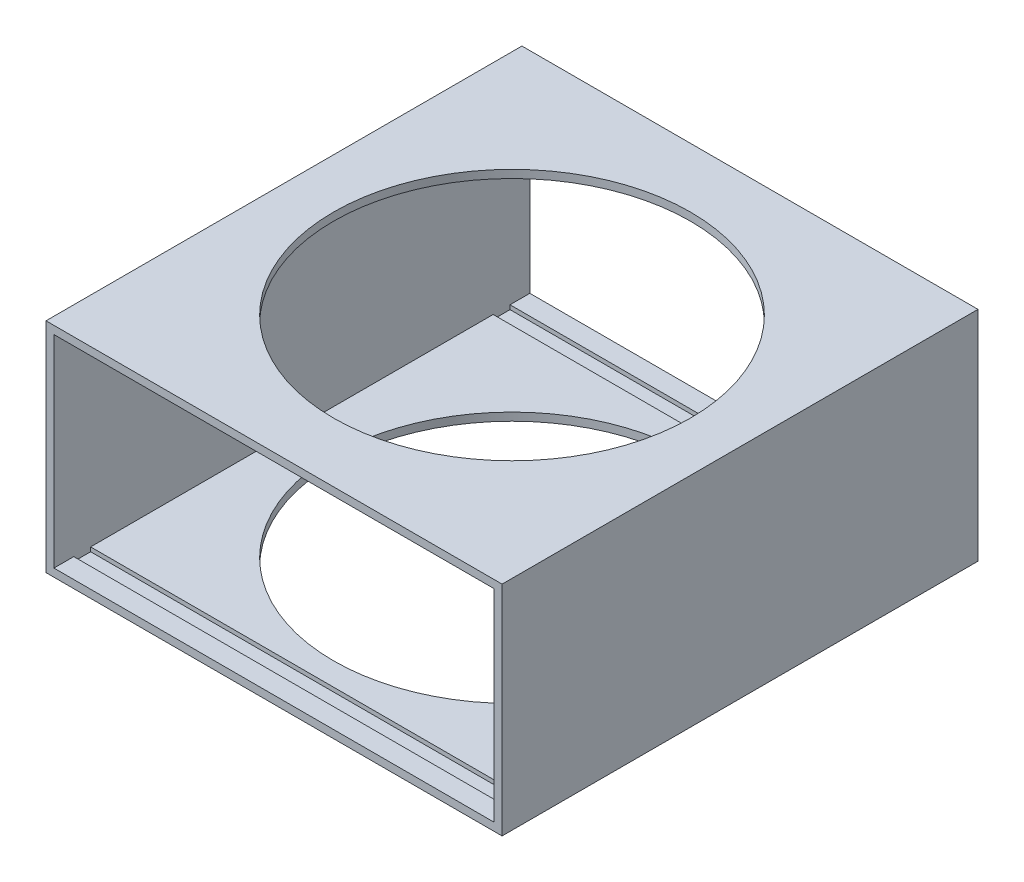
ISO-10303-21;
HEADER;
FILE_DESCRIPTION(('STEP AP214'),'2;1');
FILE_NAME('part.step','',(''),(''),'','','');
FILE_SCHEMA(('AUTOMOTIVE_DESIGN { 1 0 10303 214 1 1 1 1 }'));
ENDSEC;
DATA;
#1=APPLICATION_CONTEXT('core data for automotive mechanical design processes');
#2=APPLICATION_PROTOCOL_DEFINITION('international standard','automotive_design',2000,#1);
#3=PRODUCT_CONTEXT('',#1,'mechanical');
#4=PRODUCT('Part','Part','',(#3));
#5=PRODUCT_RELATED_PRODUCT_CATEGORY('part','',(#4));
#6=PRODUCT_DEFINITION_FORMATION('','',#4);
#7=PRODUCT_DEFINITION_CONTEXT('part definition',#1,'design');
#8=PRODUCT_DEFINITION('design','',#6,#7);
#9=PRODUCT_DEFINITION_SHAPE('','',#8);
#10=(LENGTH_UNIT() NAMED_UNIT(*) SI_UNIT(.MILLI.,.METRE.));
#11=(NAMED_UNIT(*) PLANE_ANGLE_UNIT() SI_UNIT($,.RADIAN.));
#12=(NAMED_UNIT(*) SI_UNIT($,.STERADIAN.) SOLID_ANGLE_UNIT());
#13=UNCERTAINTY_MEASURE_WITH_UNIT(LENGTH_MEASURE(1.E-05),#10,'distance_accuracy_value','');
#14=(GEOMETRIC_REPRESENTATION_CONTEXT(3) GLOBAL_UNCERTAINTY_ASSIGNED_CONTEXT((#13)) GLOBAL_UNIT_ASSIGNED_CONTEXT((#10,
#11,#12)) REPRESENTATION_CONTEXT('',''));
#15=CARTESIAN_POINT('',(0.,0.,0.));
#16=DIRECTION('',(0.,0.,1.));
#17=DIRECTION('',(1.,0.,0.));
#18=AXIS2_PLACEMENT_3D('',#15,#16,#17);
#19=CARTESIAN_POINT('',(0.,25.5,-327.47548783982));
#20=DIRECTION('',(0.,-1.,0.));
#21=DIRECTION('',(0.,0.,-1.));
#22=AXIS2_PLACEMENT_3D('',#19,#20,#21);
#23=PLANE('',#22);
#24=DIRECTION('',(-1.,0.,0.));
#25=VECTOR('',#24,1.);
#26=CARTESIAN_POINT('',(59.88360996349,25.5,-195.));
#27=LINE('',#26,#25);
#28=CARTESIAN_POINT('',(55.5,25.5,-195.));
#29=VERTEX_POINT('',#28);
#30=CARTESIAN_POINT('',(-55.5,25.5,-195.));
#31=VERTEX_POINT('',#30);
#32=EDGE_CURVE('E226',#29,#31,#27,.T.);
#33=ORIENTED_EDGE('',*,*,#32,.T.);
#34=DIRECTION('',(0.,0.,1.));
#35=VECTOR('',#34,1.);
#36=CARTESIAN_POINT('',(-55.5,25.5,-327.47548783982));
#37=LINE('',#36,#35);
#38=CARTESIAN_POINT('',(-55.5,25.5,-200.));
#39=VERTEX_POINT('',#38);
#40=EDGE_CURVE('E237',#39,#31,#37,.T.);
#41=ORIENTED_EDGE('',*,*,#40,.F.);
#42=DIRECTION('',(1.,0.,0.));
#43=VECTOR('',#42,1.);
#44=CARTESIAN_POINT('',(0.,25.5,-200.));
#45=LINE('',#44,#43);
#46=CARTESIAN_POINT('',(55.5,25.5,-200.));
#47=VERTEX_POINT('',#46);
#48=EDGE_CURVE('E310',#39,#47,#45,.T.);
#49=ORIENTED_EDGE('',*,*,#48,.T.);
#50=DIRECTION('',(0.,0.,1.));
#51=VECTOR('',#50,1.);
#52=CARTESIAN_POINT('',(55.5,25.5,-327.47548783982));
#53=LINE('',#52,#51);
#54=EDGE_CURVE('E240',#47,#29,#53,.T.);
#55=ORIENTED_EDGE('',*,*,#54,.T.);
#56=EDGE_LOOP('',(#33,#41,#49,#55));
#57=FACE_BOUND('',#56,.T.);
#58=ADVANCED_FACE('F59',(#57),#23,.T.);
#59=CARTESIAN_POINT('',(0.,-25.5,-327.47548783982));
#60=DIRECTION('',(0.,1.,0.));
#61=DIRECTION('',(0.,0.,1.));
#62=AXIS2_PLACEMENT_3D('',#59,#60,#61);
#63=PLANE('',#62);
#64=DIRECTION('',(0.,0.,1.));
#65=VECTOR('',#64,1.);
#66=CARTESIAN_POINT('',(-55.5,-25.5,-327.47548783982));
#67=LINE('',#66,#65);
#68=CARTESIAN_POINT('',(-55.5,-25.5,-200.));
#69=VERTEX_POINT('',#68);
#70=CARTESIAN_POINT('',(-55.5,-25.5,-195.));
#71=VERTEX_POINT('',#70);
#72=EDGE_CURVE('E272',#69,#71,#67,.T.);
#73=ORIENTED_EDGE('',*,*,#72,.T.);
#74=DIRECTION('',(-1.,0.,0.));
#75=VECTOR('',#74,1.);
#76=CARTESIAN_POINT('',(59.88360996349,-25.5,-195.));
#77=LINE('',#76,#75);
#78=CARTESIAN_POINT('',(55.5,-25.5,-195.));
#79=VERTEX_POINT('',#78);
#80=EDGE_CURVE('E385',#79,#71,#77,.T.);
#81=ORIENTED_EDGE('',*,*,#80,.F.);
#82=DIRECTION('',(0.,0.,1.));
#83=VECTOR('',#82,1.);
#84=CARTESIAN_POINT('',(55.5,-25.5,-327.47548783982));
#85=LINE('',#84,#83);
#86=CARTESIAN_POINT('',(55.5,-25.5,-200.));
#87=VERTEX_POINT('',#86);
#88=EDGE_CURVE('E259',#87,#79,#85,.T.);
#89=ORIENTED_EDGE('',*,*,#88,.F.);
#90=DIRECTION('',(-1.,0.,0.));
#91=VECTOR('',#90,1.);
#92=CARTESIAN_POINT('',(0.,-25.5,-200.));
#93=LINE('',#92,#91);
#94=EDGE_CURVE('E12',#87,#69,#93,.T.);
#95=ORIENTED_EDGE('',*,*,#94,.T.);
#96=EDGE_LOOP('',(#73,#81,#89,#95));
#97=FACE_BOUND('',#96,.T.);
#98=ADVANCED_FACE('F446',(#97),#63,.T.);
#99=CARTESIAN_POINT('',(0.,-25.5,-140.));
#100=DIRECTION('',(0.,1.,0.));
#101=DIRECTION('',(0.,0.,1.));
#102=AXIS2_PLACEMENT_3D('',#99,#100,#101);
#103=CIRCLE('',#102,45.);
#104=CARTESIAN_POINT('',(0.,-25.5,-95.));
#105=VERTEX_POINT('',#104);
#106=EDGE_CURVE('E317',#105,#105,#103,.T.);
#107=ORIENTED_EDGE('',*,*,#106,.F.);
#108=EDGE_LOOP('',(#107));
#109=FACE_BOUND('',#108,.T.);
#110=CARTESIAN_POINT('',(55.5,-25.5,-190.747444895786));
#111=VERTEX_POINT('',#110);
#112=CARTESIAN_POINT('',(55.5,-25.5,-89.2525551042136));
#113=VERTEX_POINT('',#112);
#114=EDGE_CURVE('E265',#111,#113,#85,.T.);
#115=ORIENTED_EDGE('',*,*,#114,.F.);
#116=DIRECTION('',(-1.,0.,0.));
#117=VECTOR('',#116,1.);
#118=CARTESIAN_POINT('',(59.88360996349,-25.5,-190.747444895786));
#119=LINE('',#118,#117);
#120=CARTESIAN_POINT('',(-55.5,-25.5,-190.747444895786));
#121=VERTEX_POINT('',#120);
#122=EDGE_CURVE('E378',#111,#121,#119,.T.);
#123=ORIENTED_EDGE('',*,*,#122,.T.);
#124=CARTESIAN_POINT('',(-55.5,-25.5,-89.2525551042136));
#125=VERTEX_POINT('',#124);
#126=EDGE_CURVE('E276',#121,#125,#67,.T.);
#127=ORIENTED_EDGE('',*,*,#126,.T.);
#128=DIRECTION('',(-1.,0.,0.));
#129=VECTOR('',#128,1.);
#130=CARTESIAN_POINT('',(59.88360996349,-25.5,-89.2525551042136));
#131=LINE('',#130,#129);
#132=EDGE_CURVE('E361',#113,#125,#131,.T.);
#133=ORIENTED_EDGE('',*,*,#132,.F.);
#134=EDGE_LOOP('',(#115,#123,#127,#133));
#135=FACE_BOUND('',#134,.T.);
#136=ADVANCED_FACE('F444',(#109,#135),#63,.T.);
#137=DIRECTION('',(-1.,0.,0.));
#138=VECTOR('',#137,1.);
#139=CARTESIAN_POINT('',(59.88360996349,-25.5,-85.));
#140=LINE('',#139,#138);
#141=CARTESIAN_POINT('',(55.5,-25.5,-85.));
#142=VERTEX_POINT('',#141);
#143=CARTESIAN_POINT('',(-55.5,-25.5,-85.));
#144=VERTEX_POINT('',#143);
#145=EDGE_CURVE('E354',#142,#144,#140,.T.);
#146=ORIENTED_EDGE('',*,*,#145,.T.);
#147=CARTESIAN_POINT('',(-55.5,-25.5,-80.));
#148=VERTEX_POINT('',#147);
#149=EDGE_CURVE('E277',#144,#148,#67,.T.);
#150=ORIENTED_EDGE('',*,*,#149,.T.);
#151=DIRECTION('',(-1.,0.,0.));
#152=VECTOR('',#151,1.);
#153=CARTESIAN_POINT('',(0.,-25.5,-80.));
#154=LINE('',#153,#152);
#155=CARTESIAN_POINT('',(55.5,-25.5,-80.));
#156=VERTEX_POINT('',#155);
#157=EDGE_CURVE('E281',#156,#148,#154,.T.);
#158=ORIENTED_EDGE('',*,*,#157,.F.);
#159=EDGE_CURVE('E266',#142,#156,#85,.T.);
#160=ORIENTED_EDGE('',*,*,#159,.F.);
#161=EDGE_LOOP('',(#146,#150,#158,#160));
#162=FACE_BOUND('',#161,.T.);
#163=ADVANCED_FACE('F437',(#162),#63,.T.);
#164=CARTESIAN_POINT('',(-55.5,25.5,-85.));
#165=VERTEX_POINT('',#164);
#166=CARTESIAN_POINT('',(-55.5,25.5,-80.));
#167=VERTEX_POINT('',#166);
#168=EDGE_CURVE('E248',#165,#167,#37,.T.);
#169=ORIENTED_EDGE('',*,*,#168,.F.);
#170=DIRECTION('',(-1.,0.,0.));
#171=VECTOR('',#170,1.);
#172=CARTESIAN_POINT('',(59.88360996349,25.5,-85.));
#173=LINE('',#172,#171);
#174=CARTESIAN_POINT('',(55.5,25.5,-85.));
#175=VERTEX_POINT('',#174);
#176=EDGE_CURVE('E335',#175,#165,#173,.T.);
#177=ORIENTED_EDGE('',*,*,#176,.F.);
#178=CARTESIAN_POINT('',(55.5,25.5,-80.));
#179=VERTEX_POINT('',#178);
#180=EDGE_CURVE('E257',#175,#179,#53,.T.);
#181=ORIENTED_EDGE('',*,*,#180,.T.);
#182=DIRECTION('',(1.,0.,0.));
#183=VECTOR('',#182,1.);
#184=CARTESIAN_POINT('',(0.,25.5,-80.));
#185=LINE('',#184,#183);
#186=EDGE_CURVE('E290',#167,#179,#185,.T.);
#187=ORIENTED_EDGE('',*,*,#186,.F.);
#188=EDGE_LOOP('',(#169,#177,#181,#187));
#189=FACE_BOUND('',#188,.T.);
#190=ADVANCED_FACE('F435',(#189),#23,.T.);
#191=DIRECTION('',(-1.,0.,0.));
#192=VECTOR('',#191,1.);
#193=CARTESIAN_POINT('',(59.88360996349,25.5,-190.747444895786));
#194=LINE('',#193,#192);
#195=CARTESIAN_POINT('',(55.5,25.5,-190.747444895786));
#196=VERTEX_POINT('',#195);
#197=CARTESIAN_POINT('',(-55.5,25.5,-190.747444895787));
#198=VERTEX_POINT('',#197);
#199=EDGE_CURVE('E403',#196,#198,#194,.T.);
#200=ORIENTED_EDGE('',*,*,#199,.F.);
#201=CARTESIAN_POINT('',(55.5,25.5,-89.2525551042136));
#202=VERTEX_POINT('',#201);
#203=EDGE_CURVE('E256',#196,#202,#53,.T.);
#204=ORIENTED_EDGE('',*,*,#203,.T.);
#205=DIRECTION('',(-1.,0.,0.));
#206=VECTOR('',#205,1.);
#207=CARTESIAN_POINT('',(59.88360996349,25.5,-89.2525551042136));
#208=LINE('',#207,#206);
#209=CARTESIAN_POINT('',(-55.5,25.5,-89.2525551042136));
#210=VERTEX_POINT('',#209);
#211=EDGE_CURVE('E328',#202,#210,#208,.T.);
#212=ORIENTED_EDGE('',*,*,#211,.T.);
#213=EDGE_CURVE('E246',#198,#210,#37,.T.);
#214=ORIENTED_EDGE('',*,*,#213,.F.);
#215=EDGE_LOOP('',(#200,#204,#212,#214));
#216=FACE_BOUND('',#215,.T.);
#217=CARTESIAN_POINT('',(0.,25.5,-140.));
#218=DIRECTION('',(0.,-1.,0.));
#219=DIRECTION('',(0.,0.,-1.));
#220=AXIS2_PLACEMENT_3D('',#217,#218,#219);
#221=CIRCLE('',#220,45.);
#222=CARTESIAN_POINT('',(0.,25.5,-185.));
#223=VERTEX_POINT('',#222);
#224=EDGE_CURVE('E63',#223,#223,#221,.T.);
#225=ORIENTED_EDGE('',*,*,#224,.F.);
#226=EDGE_LOOP('',(#225));
#227=FACE_BOUND('',#226,.T.);
#228=ADVANCED_FACE('F420',(#216,#227),#23,.T.);
#229=CARTESIAN_POINT('',(57.5,-27.5,-327.47548783982));
#230=DIRECTION('',(0.,1.,0.));
#231=DIRECTION('',(0.,0.,1.));
#232=AXIS2_PLACEMENT_3D('',#229,#230,#231);
#233=PLANE('',#232);
#234=CARTESIAN_POINT('',(0.,-27.5,-140.));
#235=DIRECTION('',(0.,1.,0.));
#236=DIRECTION('',(0.,0.,1.));
#237=AXIS2_PLACEMENT_3D('',#234,#235,#236);
#238=CIRCLE('',#237,45.);
#239=CARTESIAN_POINT('',(0.,-27.5,-95.));
#240=VERTEX_POINT('',#239);
#241=EDGE_CURVE('E320',#240,#240,#238,.F.);
#242=ORIENTED_EDGE('',*,*,#241,.F.);
#243=EDGE_LOOP('',(#242));
#244=FACE_BOUND('',#243,.T.);
#245=DIRECTION('',(-1.,0.,0.));
#246=VECTOR('',#245,1.);
#247=CARTESIAN_POINT('',(57.5,-27.5,-200.));
#248=LINE('',#247,#246);
#249=CARTESIAN_POINT('',(57.5,-27.5,-200.));
#250=VERTEX_POINT('',#249);
#251=CARTESIAN_POINT('',(-57.5,-27.5,-200.));
#252=VERTEX_POINT('',#251);
#253=EDGE_CURVE('E306',#250,#252,#248,.T.);
#254=ORIENTED_EDGE('',*,*,#253,.F.);
#255=DIRECTION('',(0.,0.,1.));
#256=VECTOR('',#255,1.);
#257=CARTESIAN_POINT('',(57.5,-27.5,-327.47548783982));
#258=LINE('',#257,#256);
#259=CARTESIAN_POINT('',(57.5,-27.5,-80.));
#260=VERTEX_POINT('',#259);
#261=EDGE_CURVE('E497',#250,#260,#258,.T.);
#262=ORIENTED_EDGE('',*,*,#261,.T.);
#263=DIRECTION('',(-1.,0.,0.));
#264=VECTOR('',#263,1.);
#265=CARTESIAN_POINT('',(57.5,-27.5,-80.));
#266=LINE('',#265,#264);
#267=CARTESIAN_POINT('',(-57.5,-27.5,-80.));
#268=VERTEX_POINT('',#267);
#269=EDGE_CURVE('E501',#260,#268,#266,.T.);
#270=ORIENTED_EDGE('',*,*,#269,.T.);
#271=DIRECTION('',(0.,0.,1.));
#272=VECTOR('',#271,1.);
#273=CARTESIAN_POINT('',(-57.5,-27.5,-327.47548783982));
#274=LINE('',#273,#272);
#275=EDGE_CURVE('E499',#252,#268,#274,.T.);
#276=ORIENTED_EDGE('',*,*,#275,.F.);
#277=EDGE_LOOP('',(#254,#262,#270,#276));
#278=FACE_BOUND('',#277,.T.);
#279=ADVANCED_FACE('F443',(#244,#278),#233,.F.);
#280=CARTESIAN_POINT('',(57.5,-27.5,-327.47548783982));
#281=DIRECTION('',(-1.,0.,0.));
#282=DIRECTION('',(0.,0.,1.));
#283=AXIS2_PLACEMENT_3D('',#280,#281,#282);
#284=PLANE('',#283);
#285=DIRECTION('',(0.,-1.,0.));
#286=VECTOR('',#285,1.);
#287=CARTESIAN_POINT('',(57.5,-27.5,-200.));
#288=LINE('',#287,#286);
#289=CARTESIAN_POINT('',(57.5,27.5,-200.));
#290=VERTEX_POINT('',#289);
#291=EDGE_CURVE('E303',#290,#250,#288,.T.);
#292=ORIENTED_EDGE('',*,*,#291,.F.);
#293=DIRECTION('',(0.,0.,1.));
#294=VECTOR('',#293,1.);
#295=CARTESIAN_POINT('',(57.5,27.5,-327.47548783982));
#296=LINE('',#295,#294);
#297=CARTESIAN_POINT('',(57.5,27.5,-80.));
#298=VERTEX_POINT('',#297);
#299=EDGE_CURVE('E490',#290,#298,#296,.T.);
#300=ORIENTED_EDGE('',*,*,#299,.T.);
#301=DIRECTION('',(0.,-1.,0.));
#302=VECTOR('',#301,1.);
#303=CARTESIAN_POINT('',(57.5,-27.5,-80.));
#304=LINE('',#303,#302);
#305=EDGE_CURVE('E504',#298,#260,#304,.T.);
#306=ORIENTED_EDGE('',*,*,#305,.T.);
#307=ORIENTED_EDGE('',*,*,#261,.F.);
#308=EDGE_LOOP('',(#292,#300,#306,#307));
#309=FACE_BOUND('',#308,.T.);
#310=ADVANCED_FACE('F476',(#309),#284,.F.);
#311=CARTESIAN_POINT('',(57.5,27.5,-327.47548783982));
#312=DIRECTION('',(0.,-1.,0.));
#313=DIRECTION('',(0.,0.,-1.));
#314=AXIS2_PLACEMENT_3D('',#311,#312,#313);
#315=PLANE('',#314);
#316=CARTESIAN_POINT('',(0.,27.5,-140.));
#317=DIRECTION('',(0.,-1.,0.));
#318=DIRECTION('',(0.,0.,-1.));
#319=AXIS2_PLACEMENT_3D('',#316,#317,#318);
#320=CIRCLE('',#319,45.);
#321=CARTESIAN_POINT('',(0.,27.5,-185.));
#322=VERTEX_POINT('',#321);
#323=EDGE_CURVE('E314',#322,#322,#320,.T.);
#324=ORIENTED_EDGE('',*,*,#323,.T.);
#325=EDGE_LOOP('',(#324));
#326=FACE_BOUND('',#325,.T.);
#327=DIRECTION('',(1.,0.,0.));
#328=VECTOR('',#327,1.);
#329=CARTESIAN_POINT('',(57.5,27.5,-200.));
#330=LINE('',#329,#328);
#331=CARTESIAN_POINT('',(-57.5,27.5,-200.));
#332=VERTEX_POINT('',#331);
#333=EDGE_CURVE('E300',#332,#290,#330,.T.);
#334=ORIENTED_EDGE('',*,*,#333,.F.);
#335=DIRECTION('',(0.,0.,1.));
#336=VECTOR('',#335,1.);
#337=CARTESIAN_POINT('',(-57.5,27.5,-327.47548783982));
#338=LINE('',#337,#336);
#339=CARTESIAN_POINT('',(-57.5,27.5,-80.));
#340=VERTEX_POINT('',#339);
#341=EDGE_CURVE('E68',#332,#340,#338,.T.);
#342=ORIENTED_EDGE('',*,*,#341,.T.);
#343=DIRECTION('',(1.,0.,0.));
#344=VECTOR('',#343,1.);
#345=CARTESIAN_POINT('',(57.5,27.5,-80.));
#346=LINE('',#345,#344);
#347=EDGE_CURVE('E250',#340,#298,#346,.T.);
#348=ORIENTED_EDGE('',*,*,#347,.T.);
#349=ORIENTED_EDGE('',*,*,#299,.F.);
#350=EDGE_LOOP('',(#334,#342,#348,#349));
#351=FACE_BOUND('',#350,.T.);
#352=ADVANCED_FACE('F470',(#326,#351),#315,.F.);
#353=CARTESIAN_POINT('',(-57.5,-27.5,-327.47548783982));
#354=DIRECTION('',(1.,0.,0.));
#355=DIRECTION('',(0.,0.,-1.));
#356=AXIS2_PLACEMENT_3D('',#353,#354,#355);
#357=PLANE('',#356);
#358=DIRECTION('',(0.,1.,0.));
#359=VECTOR('',#358,1.);
#360=CARTESIAN_POINT('',(-57.5,-27.5,-200.));
#361=LINE('',#360,#359);
#362=EDGE_CURVE('E297',#252,#332,#361,.T.);
#363=ORIENTED_EDGE('',*,*,#362,.F.);
#364=ORIENTED_EDGE('',*,*,#275,.T.);
#365=DIRECTION('',(0.,1.,0.));
#366=VECTOR('',#365,1.);
#367=CARTESIAN_POINT('',(-57.5,-27.5,-80.));
#368=LINE('',#367,#366);
#369=EDGE_CURVE('E245',#268,#340,#368,.T.);
#370=ORIENTED_EDGE('',*,*,#369,.T.);
#371=ORIENTED_EDGE('',*,*,#341,.F.);
#372=EDGE_LOOP('',(#363,#364,#370,#371));
#373=FACE_BOUND('',#372,.T.);
#374=ADVANCED_FACE('F61',(#373),#357,.F.);
#375=CARTESIAN_POINT('',(0.,0.,-80.));
#376=DIRECTION('',(0.,0.,-1.));
#377=DIRECTION('',(-1.,0.,0.));
#378=AXIS2_PLACEMENT_3D('',#375,#376,#377);
#379=PLANE('',#378);
#380=ORIENTED_EDGE('',*,*,#369,.F.);
#381=ORIENTED_EDGE('',*,*,#269,.F.);
#382=ORIENTED_EDGE('',*,*,#305,.F.);
#383=ORIENTED_EDGE('',*,*,#347,.F.);
#384=EDGE_LOOP('',(#380,#381,#382,#383));
#385=FACE_BOUND('',#384,.T.);
#386=DIRECTION('',(0.,1.,0.));
#387=VECTOR('',#386,1.);
#388=CARTESIAN_POINT('',(-55.5,0.,-80.));
#389=LINE('',#388,#387);
#390=EDGE_CURVE('E295',#148,#167,#389,.T.);
#391=ORIENTED_EDGE('',*,*,#390,.T.);
#392=ORIENTED_EDGE('',*,*,#186,.T.);
#393=DIRECTION('',(0.,-1.,0.));
#394=VECTOR('',#393,1.);
#395=CARTESIAN_POINT('',(55.5,0.,-80.));
#396=LINE('',#395,#394);
#397=EDGE_CURVE('E286',#179,#156,#396,.T.);
#398=ORIENTED_EDGE('',*,*,#397,.T.);
#399=ORIENTED_EDGE('',*,*,#157,.T.);
#400=EDGE_LOOP('',(#391,#392,#398,#399));
#401=FACE_BOUND('',#400,.T.);
#402=ADVANCED_FACE('F434',(#385,#401),#379,.F.);
#403=CARTESIAN_POINT('',(55.5,0.,-327.47548783982));
#404=DIRECTION('',(-1.,0.,0.));
#405=DIRECTION('',(0.,0.,1.));
#406=AXIS2_PLACEMENT_3D('',#403,#404,#405);
#407=PLANE('',#406);
#408=ORIENTED_EDGE('',*,*,#54,.F.);
#409=DIRECTION('',(0.,-1.,0.));
#410=VECTOR('',#409,1.);
#411=CARTESIAN_POINT('',(55.5,0.,-200.));
#412=LINE('',#411,#410);
#413=EDGE_CURVE('E312',#47,#87,#412,.T.);
#414=ORIENTED_EDGE('',*,*,#413,.T.);
#415=ORIENTED_EDGE('',*,*,#88,.T.);
#416=DIRECTION('',(0.,-1.,0.));
#417=VECTOR('',#416,1.);
#418=CARTESIAN_POINT('',(55.5,-25.5,-195.));
#419=LINE('',#418,#417);
#420=CARTESIAN_POINT('',(55.5,-26.563866249881,-195.));
#421=VERTEX_POINT('',#420);
#422=EDGE_CURVE('E375',#79,#421,#419,.T.);
#423=ORIENTED_EDGE('',*,*,#422,.T.);
#424=DIRECTION('',(0.,0.,1.));
#425=VECTOR('',#424,1.);
#426=CARTESIAN_POINT('',(55.5,-26.563866249881,-195.));
#427=LINE('',#426,#425);
#428=CARTESIAN_POINT('',(55.5,-26.563866249881,-190.747444895786));
#429=VERTEX_POINT('',#428);
#430=EDGE_CURVE('E377',#421,#429,#427,.T.);
#431=ORIENTED_EDGE('',*,*,#430,.T.);
#432=DIRECTION('',(0.,1.,0.));
#433=VECTOR('',#432,1.);
#434=CARTESIAN_POINT('',(55.5,-26.563866249881,-190.747444895786));
#435=LINE('',#434,#433);
#436=EDGE_CURVE('E372',#429,#111,#435,.T.);
#437=ORIENTED_EDGE('',*,*,#436,.T.);
#438=ORIENTED_EDGE('',*,*,#114,.T.);
#439=DIRECTION('',(0.,1.,0.));
#440=VECTOR('',#439,1.);
#441=CARTESIAN_POINT('',(55.5,-26.563866249881,-89.2525551042136));
#442=LINE('',#441,#440);
#443=CARTESIAN_POINT('',(55.5,-26.563866249881,-89.2525551042136));
#444=VERTEX_POINT('',#443);
#445=EDGE_CURVE('E346',#444,#113,#442,.T.);
#446=ORIENTED_EDGE('',*,*,#445,.F.);
#447=DIRECTION('',(0.,0.,-1.));
#448=VECTOR('',#447,1.);
#449=CARTESIAN_POINT('',(55.5,-26.563866249881,-85.));
#450=LINE('',#449,#448);
#451=CARTESIAN_POINT('',(55.5,-26.563866249881,-85.));
#452=VERTEX_POINT('',#451);
#453=EDGE_CURVE('E356',#452,#444,#450,.T.);
#454=ORIENTED_EDGE('',*,*,#453,.F.);
#455=DIRECTION('',(0.,-1.,0.));
#456=VECTOR('',#455,1.);
#457=CARTESIAN_POINT('',(55.5,-25.5,-85.));
#458=LINE('',#457,#456);
#459=EDGE_CURVE('E353',#142,#452,#458,.T.);
#460=ORIENTED_EDGE('',*,*,#459,.F.);
#461=ORIENTED_EDGE('',*,*,#159,.T.);
#462=ORIENTED_EDGE('',*,*,#397,.F.);
#463=ORIENTED_EDGE('',*,*,#180,.F.);
#464=DIRECTION('',(0.,1.,0.));
#465=VECTOR('',#464,1.);
#466=CARTESIAN_POINT('',(55.5,25.5,-85.));
#467=LINE('',#466,#465);
#468=CARTESIAN_POINT('',(55.5,26.563866249881,-85.));
#469=VERTEX_POINT('',#468);
#470=EDGE_CURVE('E324',#175,#469,#467,.T.);
#471=ORIENTED_EDGE('',*,*,#470,.T.);
#472=DIRECTION('',(0.,0.,-1.));
#473=VECTOR('',#472,1.);
#474=CARTESIAN_POINT('',(55.5,26.563866249881,-85.));
#475=LINE('',#474,#473);
#476=CARTESIAN_POINT('',(55.5,26.563866249881,-89.2525551042136));
#477=VERTEX_POINT('',#476);
#478=EDGE_CURVE('E327',#469,#477,#475,.T.);
#479=ORIENTED_EDGE('',*,*,#478,.T.);
#480=DIRECTION('',(0.,-1.,0.));
#481=VECTOR('',#480,1.);
#482=CARTESIAN_POINT('',(55.5,26.563866249881,-89.2525551042136));
#483=LINE('',#482,#481);
#484=EDGE_CURVE('E323',#477,#202,#483,.T.);
#485=ORIENTED_EDGE('',*,*,#484,.T.);
#486=ORIENTED_EDGE('',*,*,#203,.F.);
#487=DIRECTION('',(0.,-1.,0.));
#488=VECTOR('',#487,1.);
#489=CARTESIAN_POINT('',(55.5,26.563866249881,-190.747444895786));
#490=LINE('',#489,#488);
#491=CARTESIAN_POINT('',(55.5,26.563866249881,-190.747444895786));
#492=VERTEX_POINT('',#491);
#493=EDGE_CURVE('E393',#492,#196,#490,.T.);
#494=ORIENTED_EDGE('',*,*,#493,.F.);
#495=DIRECTION('',(0.,0.,1.));
#496=VECTOR('',#495,1.);
#497=CARTESIAN_POINT('',(55.5,26.563866249881,-195.));
#498=LINE('',#497,#496);
#499=CARTESIAN_POINT('',(55.5,26.563866249881,-195.));
#500=VERTEX_POINT('',#499);
#501=EDGE_CURVE('E241',#500,#492,#498,.T.);
#502=ORIENTED_EDGE('',*,*,#501,.F.);
#503=DIRECTION('',(0.,1.,0.));
#504=VECTOR('',#503,1.);
#505=CARTESIAN_POINT('',(55.5,25.5,-195.));
#506=LINE('',#505,#504);
#507=EDGE_CURVE('E398',#29,#500,#506,.T.);
#508=ORIENTED_EDGE('',*,*,#507,.F.);
#509=EDGE_LOOP('',(#408,#414,#415,#423,#431,#437,#438,#446,#454,#460,#461,#462,#463,#471,#479,
#485,#486,#494,#502,#508));
#510=FACE_BOUND('',#509,.T.);
#511=ADVANCED_FACE('F417',(#510),#407,.T.);
#512=CARTESIAN_POINT('',(-55.5,0.,-327.47548783982));
#513=DIRECTION('',(1.,0.,0.));
#514=DIRECTION('',(0.,0.,-1.));
#515=AXIS2_PLACEMENT_3D('',#512,#513,#514);
#516=PLANE('',#515);
#517=ORIENTED_EDGE('',*,*,#72,.F.);
#518=DIRECTION('',(0.,1.,0.));
#519=VECTOR('',#518,1.);
#520=CARTESIAN_POINT('',(-55.5,0.,-200.));
#521=LINE('',#520,#519);
#522=EDGE_CURVE('E244',#69,#39,#521,.T.);
#523=ORIENTED_EDGE('',*,*,#522,.T.);
#524=ORIENTED_EDGE('',*,*,#40,.T.);
#525=DIRECTION('',(0.,-1.,0.));
#526=VECTOR('',#525,1.);
#527=CARTESIAN_POINT('',(-55.5,25.5,-195.));
#528=LINE('',#527,#526);
#529=CARTESIAN_POINT('',(-55.5,26.563866249881,-195.));
#530=VERTEX_POINT('',#529);
#531=EDGE_CURVE('E223',#530,#31,#528,.T.);
#532=ORIENTED_EDGE('',*,*,#531,.F.);
#533=DIRECTION('',(0.,0.,-1.));
#534=VECTOR('',#533,1.);
#535=CARTESIAN_POINT('',(-55.5,26.563866249881,-195.));
#536=LINE('',#535,#534);
#537=CARTESIAN_POINT('',(-55.5,26.563866249881,-190.747444895786));
#538=VERTEX_POINT('',#537);
#539=EDGE_CURVE('E232',#538,#530,#536,.T.);
#540=ORIENTED_EDGE('',*,*,#539,.F.);
#541=DIRECTION('',(0.,1.,0.));
#542=VECTOR('',#541,1.);
#543=CARTESIAN_POINT('',(-55.5,26.563866249881,-190.747444895786));
#544=LINE('',#543,#542);
#545=EDGE_CURVE('E75',#198,#538,#544,.T.);
#546=ORIENTED_EDGE('',*,*,#545,.F.);
#547=ORIENTED_EDGE('',*,*,#213,.T.);
#548=DIRECTION('',(0.,1.,0.));
#549=VECTOR('',#548,1.);
#550=CARTESIAN_POINT('',(-55.5,26.563866249881,-89.2525551042136));
#551=LINE('',#550,#549);
#552=CARTESIAN_POINT('',(-55.5,26.563866249881,-89.2525551042136));
#553=VERTEX_POINT('',#552);
#554=EDGE_CURVE('E343',#210,#553,#551,.T.);
#555=ORIENTED_EDGE('',*,*,#554,.T.);
#556=DIRECTION('',(0.,0.,1.));
#557=VECTOR('',#556,1.);
#558=CARTESIAN_POINT('',(-55.5,26.563866249881,-85.));
#559=LINE('',#558,#557);
#560=CARTESIAN_POINT('',(-55.5,26.563866249881,-85.));
#561=VERTEX_POINT('',#560);
#562=EDGE_CURVE('E340',#553,#561,#559,.T.);
#563=ORIENTED_EDGE('',*,*,#562,.T.);
#564=DIRECTION('',(0.,-1.,0.));
#565=VECTOR('',#564,1.);
#566=CARTESIAN_POINT('',(-55.5,25.5,-85.));
#567=LINE('',#566,#565);
#568=EDGE_CURVE('E338',#561,#165,#567,.T.);
#569=ORIENTED_EDGE('',*,*,#568,.T.);
#570=ORIENTED_EDGE('',*,*,#168,.T.);
#571=ORIENTED_EDGE('',*,*,#390,.F.);
#572=ORIENTED_EDGE('',*,*,#149,.F.);
#573=DIRECTION('',(0.,1.,0.));
#574=VECTOR('',#573,1.);
#575=CARTESIAN_POINT('',(-55.5,-25.5,-85.));
#576=LINE('',#575,#574);
#577=CARTESIAN_POINT('',(-55.5,-26.563866249881,-85.));
#578=VERTEX_POINT('',#577);
#579=EDGE_CURVE('E370',#578,#144,#576,.T.);
#580=ORIENTED_EDGE('',*,*,#579,.F.);
#581=DIRECTION('',(0.,0.,1.));
#582=VECTOR('',#581,1.);
#583=CARTESIAN_POINT('',(-55.5,-26.563866249881,-85.));
#584=LINE('',#583,#582);
#585=CARTESIAN_POINT('',(-55.5,-26.563866249881,-89.2525551042136));
#586=VERTEX_POINT('',#585);
#587=EDGE_CURVE('E367',#586,#578,#584,.T.);
#588=ORIENTED_EDGE('',*,*,#587,.F.);
#589=DIRECTION('',(0.,-1.,0.));
#590=VECTOR('',#589,1.);
#591=CARTESIAN_POINT('',(-55.5,-26.563866249881,-89.2525551042136));
#592=LINE('',#591,#590);
#593=EDGE_CURVE('E364',#125,#586,#592,.T.);
#594=ORIENTED_EDGE('',*,*,#593,.F.);
#595=ORIENTED_EDGE('',*,*,#126,.F.);
#596=DIRECTION('',(0.,-1.,0.));
#597=VECTOR('',#596,1.);
#598=CARTESIAN_POINT('',(-55.5,-26.563866249881,-190.747444895786));
#599=LINE('',#598,#597);
#600=CARTESIAN_POINT('',(-55.5,-26.563866249881,-190.747444895786));
#601=VERTEX_POINT('',#600);
#602=EDGE_CURVE('E390',#121,#601,#599,.T.);
#603=ORIENTED_EDGE('',*,*,#602,.T.);
#604=DIRECTION('',(0.,0.,-1.));
#605=VECTOR('',#604,1.);
#606=CARTESIAN_POINT('',(-55.5,-26.563866249881,-195.));
#607=LINE('',#606,#605);
#608=CARTESIAN_POINT('',(-55.5,-26.563866249881,-195.));
#609=VERTEX_POINT('',#608);
#610=EDGE_CURVE('E388',#601,#609,#607,.T.);
#611=ORIENTED_EDGE('',*,*,#610,.T.);
#612=DIRECTION('',(0.,1.,0.));
#613=VECTOR('',#612,1.);
#614=CARTESIAN_POINT('',(-55.5,-25.5,-195.));
#615=LINE('',#614,#613);
#616=EDGE_CURVE('E82',#609,#71,#615,.T.);
#617=ORIENTED_EDGE('',*,*,#616,.T.);
#618=EDGE_LOOP('',(#517,#523,#524,#532,#540,#546,#547,#555,#563,#569,#570,#571,#572,#580,#588,
#594,#595,#603,#611,#617));
#619=FACE_BOUND('',#618,.T.);
#620=ADVANCED_FACE('F243',(#619),#516,.T.);
#621=CARTESIAN_POINT('',(0.,0.,-200.));
#622=DIRECTION('',(0.,0.,-1.));
#623=DIRECTION('',(-1.,0.,0.));
#624=AXIS2_PLACEMENT_3D('',#621,#622,#623);
#625=PLANE('',#624);
#626=ORIENTED_EDGE('',*,*,#522,.F.);
#627=ORIENTED_EDGE('',*,*,#94,.F.);
#628=ORIENTED_EDGE('',*,*,#413,.F.);
#629=ORIENTED_EDGE('',*,*,#48,.F.);
#630=EDGE_LOOP('',(#626,#627,#628,#629));
#631=FACE_BOUND('',#630,.T.);
#632=ORIENTED_EDGE('',*,*,#253,.T.);
#633=ORIENTED_EDGE('',*,*,#362,.T.);
#634=ORIENTED_EDGE('',*,*,#333,.T.);
#635=ORIENTED_EDGE('',*,*,#291,.T.);
#636=EDGE_LOOP('',(#632,#633,#634,#635));
#637=FACE_BOUND('',#636,.T.);
#638=ADVANCED_FACE('F458',(#631,#637),#625,.T.);
#639=CARTESIAN_POINT('',(0.,-154.779220613579,-140.));
#640=DIRECTION('',(0.,1.,0.));
#641=DIRECTION('',(0.,0.,1.));
#642=AXIS2_PLACEMENT_3D('',#639,#640,#641);
#643=CYLINDRICAL_SURFACE('',#642,45.);
#644=ORIENTED_EDGE('',*,*,#224,.T.);
#645=EDGE_LOOP('',(#644));
#646=FACE_BOUND('',#645,.T.);
#647=ORIENTED_EDGE('',*,*,#323,.F.);
#648=EDGE_LOOP('',(#647));
#649=FACE_BOUND('',#648,.T.);
#650=ADVANCED_FACE('F511',(#646,#649),#643,.F.);
#651=ORIENTED_EDGE('',*,*,#106,.T.);
#652=EDGE_LOOP('',(#651));
#653=FACE_BOUND('',#652,.T.);
#654=ORIENTED_EDGE('',*,*,#241,.T.);
#655=EDGE_LOOP('',(#654));
#656=FACE_BOUND('',#655,.T.);
#657=ADVANCED_FACE('F516',(#653,#656),#643,.F.);
#658=CARTESIAN_POINT('',(59.88360996349,25.5,-85.));
#659=DIRECTION('',(0.,0.,-1.));
#660=DIRECTION('',(-1.,0.,0.));
#661=AXIS2_PLACEMENT_3D('',#658,#659,#660);
#662=PLANE('',#661);
#663=ORIENTED_EDGE('',*,*,#176,.T.);
#664=ORIENTED_EDGE('',*,*,#568,.F.);
#665=DIRECTION('',(-1.,0.,0.));
#666=VECTOR('',#665,1.);
#667=CARTESIAN_POINT('',(59.88360996349,26.563866249881,-85.));
#668=LINE('',#667,#666);
#669=EDGE_CURVE('E333',#469,#561,#668,.T.);
#670=ORIENTED_EDGE('',*,*,#669,.F.);
#671=ORIENTED_EDGE('',*,*,#470,.F.);
#672=EDGE_LOOP('',(#663,#664,#670,#671));
#673=FACE_BOUND('',#672,.T.);
#674=ADVANCED_FACE('F433',(#673),#662,.T.);
#675=CARTESIAN_POINT('',(59.88360996349,26.563866249881,-85.));
#676=DIRECTION('',(0.,-1.,0.));
#677=DIRECTION('',(0.,0.,-1.));
#678=AXIS2_PLACEMENT_3D('',#675,#676,#677);
#679=PLANE('',#678);
#680=ORIENTED_EDGE('',*,*,#669,.T.);
#681=ORIENTED_EDGE('',*,*,#562,.F.);
#682=DIRECTION('',(-1.,0.,0.));
#683=VECTOR('',#682,1.);
#684=CARTESIAN_POINT('',(59.88360996349,26.563866249881,-89.2525551042136));
#685=LINE('',#684,#683);
#686=EDGE_CURVE('E331',#477,#553,#685,.T.);
#687=ORIENTED_EDGE('',*,*,#686,.F.);
#688=ORIENTED_EDGE('',*,*,#478,.F.);
#689=EDGE_LOOP('',(#680,#681,#687,#688));
#690=FACE_BOUND('',#689,.T.);
#691=ADVANCED_FACE('F430',(#690),#679,.T.);
#692=CARTESIAN_POINT('',(59.88360996349,26.563866249881,-89.2525551042136));
#693=DIRECTION('',(0.,0.,1.));
#694=DIRECTION('',(0.,-1.,0.));
#695=AXIS2_PLACEMENT_3D('',#692,#693,#694);
#696=PLANE('',#695);
#697=ORIENTED_EDGE('',*,*,#686,.T.);
#698=ORIENTED_EDGE('',*,*,#554,.F.);
#699=ORIENTED_EDGE('',*,*,#211,.F.);
#700=ORIENTED_EDGE('',*,*,#484,.F.);
#701=EDGE_LOOP('',(#697,#698,#699,#700));
#702=FACE_BOUND('',#701,.T.);
#703=ADVANCED_FACE('F425',(#702),#696,.T.);
#704=CARTESIAN_POINT('',(59.88360996349,-25.5,-85.));
#705=DIRECTION('',(0.,0.,1.));
#706=DIRECTION('',(1.,0.,0.));
#707=AXIS2_PLACEMENT_3D('',#704,#705,#706);
#708=PLANE('',#707);
#709=ORIENTED_EDGE('',*,*,#459,.T.);
#710=DIRECTION('',(-1.,0.,0.));
#711=VECTOR('',#710,1.);
#712=CARTESIAN_POINT('',(59.88360996349,-26.563866249881,-85.));
#713=LINE('',#712,#711);
#714=EDGE_CURVE('E357',#452,#578,#713,.T.);
#715=ORIENTED_EDGE('',*,*,#714,.T.);
#716=ORIENTED_EDGE('',*,*,#579,.T.);
#717=ORIENTED_EDGE('',*,*,#145,.F.);
#718=EDGE_LOOP('',(#709,#715,#716,#717));
#719=FACE_BOUND('',#718,.T.);
#720=ADVANCED_FACE('F544',(#719),#708,.F.);
#721=CARTESIAN_POINT('',(59.88360996349,-26.563866249881,-85.));
#722=DIRECTION('',(0.,-1.,0.));
#723=DIRECTION('',(0.,0.,-1.));
#724=AXIS2_PLACEMENT_3D('',#721,#722,#723);
#725=PLANE('',#724);
#726=ORIENTED_EDGE('',*,*,#453,.T.);
#727=DIRECTION('',(-1.,0.,0.));
#728=VECTOR('',#727,1.);
#729=CARTESIAN_POINT('',(59.88360996349,-26.563866249881,-89.2525551042136));
#730=LINE('',#729,#728);
#731=EDGE_CURVE('E359',#444,#586,#730,.T.);
#732=ORIENTED_EDGE('',*,*,#731,.T.);
#733=ORIENTED_EDGE('',*,*,#587,.T.);
#734=ORIENTED_EDGE('',*,*,#714,.F.);
#735=EDGE_LOOP('',(#726,#732,#733,#734));
#736=FACE_BOUND('',#735,.T.);
#737=ADVANCED_FACE('F539',(#736),#725,.F.);
#738=CARTESIAN_POINT('',(59.88360996349,-26.563866249881,-89.2525551042136));
#739=DIRECTION('',(0.,0.,-1.));
#740=DIRECTION('',(0.,1.,0.));
#741=AXIS2_PLACEMENT_3D('',#738,#739,#740);
#742=PLANE('',#741);
#743=ORIENTED_EDGE('',*,*,#445,.T.);
#744=ORIENTED_EDGE('',*,*,#132,.T.);
#745=ORIENTED_EDGE('',*,*,#593,.T.);
#746=ORIENTED_EDGE('',*,*,#731,.F.);
#747=EDGE_LOOP('',(#743,#744,#745,#746));
#748=FACE_BOUND('',#747,.T.);
#749=ADVANCED_FACE('F537',(#748),#742,.F.);
#750=CARTESIAN_POINT('',(59.88360996349,-25.5,-195.));
#751=DIRECTION('',(0.,0.,1.));
#752=DIRECTION('',(1.,0.,0.));
#753=AXIS2_PLACEMENT_3D('',#750,#751,#752);
#754=PLANE('',#753);
#755=ORIENTED_EDGE('',*,*,#80,.T.);
#756=ORIENTED_EDGE('',*,*,#616,.F.);
#757=DIRECTION('',(-1.,0.,0.));
#758=VECTOR('',#757,1.);
#759=CARTESIAN_POINT('',(59.88360996349,-26.563866249881,-195.));
#760=LINE('',#759,#758);
#761=EDGE_CURVE('E383',#421,#609,#760,.T.);
#762=ORIENTED_EDGE('',*,*,#761,.F.);
#763=ORIENTED_EDGE('',*,*,#422,.F.);
#764=EDGE_LOOP('',(#755,#756,#762,#763));
#765=FACE_BOUND('',#764,.T.);
#766=ADVANCED_FACE('F519',(#765),#754,.T.);
#767=CARTESIAN_POINT('',(59.88360996349,-26.563866249881,-195.));
#768=DIRECTION('',(0.,1.,0.));
#769=DIRECTION('',(0.,0.,1.));
#770=AXIS2_PLACEMENT_3D('',#767,#768,#769);
#771=PLANE('',#770);
#772=ORIENTED_EDGE('',*,*,#761,.T.);
#773=ORIENTED_EDGE('',*,*,#610,.F.);
#774=DIRECTION('',(-1.,0.,0.));
#775=VECTOR('',#774,1.);
#776=CARTESIAN_POINT('',(59.88360996349,-26.563866249881,-190.747444895786));
#777=LINE('',#776,#775);
#778=EDGE_CURVE('E381',#429,#601,#777,.T.);
#779=ORIENTED_EDGE('',*,*,#778,.F.);
#780=ORIENTED_EDGE('',*,*,#430,.F.);
#781=EDGE_LOOP('',(#772,#773,#779,#780));
#782=FACE_BOUND('',#781,.T.);
#783=ADVANCED_FACE('F524',(#782),#771,.T.);
#784=CARTESIAN_POINT('',(59.88360996349,-26.563866249881,-190.747444895786));
#785=DIRECTION('',(0.,0.,-1.));
#786=DIRECTION('',(0.,1.,0.));
#787=AXIS2_PLACEMENT_3D('',#784,#785,#786);
#788=PLANE('',#787);
#789=ORIENTED_EDGE('',*,*,#778,.T.);
#790=ORIENTED_EDGE('',*,*,#602,.F.);
#791=ORIENTED_EDGE('',*,*,#122,.F.);
#792=ORIENTED_EDGE('',*,*,#436,.F.);
#793=EDGE_LOOP('',(#789,#790,#791,#792));
#794=FACE_BOUND('',#793,.T.);
#795=ADVANCED_FACE('F527',(#794),#788,.T.);
#796=CARTESIAN_POINT('',(59.88360996349,25.5,-195.));
#797=DIRECTION('',(0.,0.,-1.));
#798=DIRECTION('',(-1.,0.,0.));
#799=AXIS2_PLACEMENT_3D('',#796,#797,#798);
#800=PLANE('',#799);
#801=ORIENTED_EDGE('',*,*,#507,.T.);
#802=DIRECTION('',(-1.,0.,0.));
#803=VECTOR('',#802,1.);
#804=CARTESIAN_POINT('',(59.88360996349,26.563866249881,-195.));
#805=LINE('',#804,#803);
#806=EDGE_CURVE('E229',#500,#530,#805,.T.);
#807=ORIENTED_EDGE('',*,*,#806,.T.);
#808=ORIENTED_EDGE('',*,*,#531,.T.);
#809=ORIENTED_EDGE('',*,*,#32,.F.);
#810=EDGE_LOOP('',(#801,#807,#808,#809));
#811=FACE_BOUND('',#810,.T.);
#812=ADVANCED_FACE('F225',(#811),#800,.F.);
#813=CARTESIAN_POINT('',(59.88360996349,26.563866249881,-195.));
#814=DIRECTION('',(0.,1.,0.));
#815=DIRECTION('',(0.,0.,1.));
#816=AXIS2_PLACEMENT_3D('',#813,#814,#815);
#817=PLANE('',#816);
#818=ORIENTED_EDGE('',*,*,#501,.T.);
#819=DIRECTION('',(-1.,0.,0.));
#820=VECTOR('',#819,1.);
#821=CARTESIAN_POINT('',(59.88360996349,26.563866249881,-190.747444895786));
#822=LINE('',#821,#820);
#823=EDGE_CURVE('E401',#492,#538,#822,.T.);
#824=ORIENTED_EDGE('',*,*,#823,.T.);
#825=ORIENTED_EDGE('',*,*,#539,.T.);
#826=ORIENTED_EDGE('',*,*,#806,.F.);
#827=EDGE_LOOP('',(#818,#824,#825,#826));
#828=FACE_BOUND('',#827,.T.);
#829=ADVANCED_FACE('F411',(#828),#817,.F.);
#830=CARTESIAN_POINT('',(59.88360996349,26.563866249881,-190.747444895786));
#831=DIRECTION('',(0.,0.,1.));
#832=DIRECTION('',(0.,-1.,0.));
#833=AXIS2_PLACEMENT_3D('',#830,#831,#832);
#834=PLANE('',#833);
#835=ORIENTED_EDGE('',*,*,#493,.T.);
#836=ORIENTED_EDGE('',*,*,#199,.T.);
#837=ORIENTED_EDGE('',*,*,#545,.T.);
#838=ORIENTED_EDGE('',*,*,#823,.F.);
#839=EDGE_LOOP('',(#835,#836,#837,#838));
#840=FACE_BOUND('',#839,.T.);
#841=ADVANCED_FACE('F414',(#840),#834,.F.);
#842=CLOSED_SHELL('',(#58,#98,#136,#163,#190,#228,#279,#310,#352,#374,#402,#511,#620,#638,#650,
#657,#674,#691,#703,#720,#737,#749,#766,#783,#795,#812,#829,#841));
#843=MANIFOLD_SOLID_BREP('B2',#842);
#844=ADVANCED_BREP_SHAPE_REPRESENTATION('',(#18,#843),#14);
#845=SHAPE_DEFINITION_REPRESENTATION(#9,#844);
ENDSEC;
END-ISO-10303-21;
